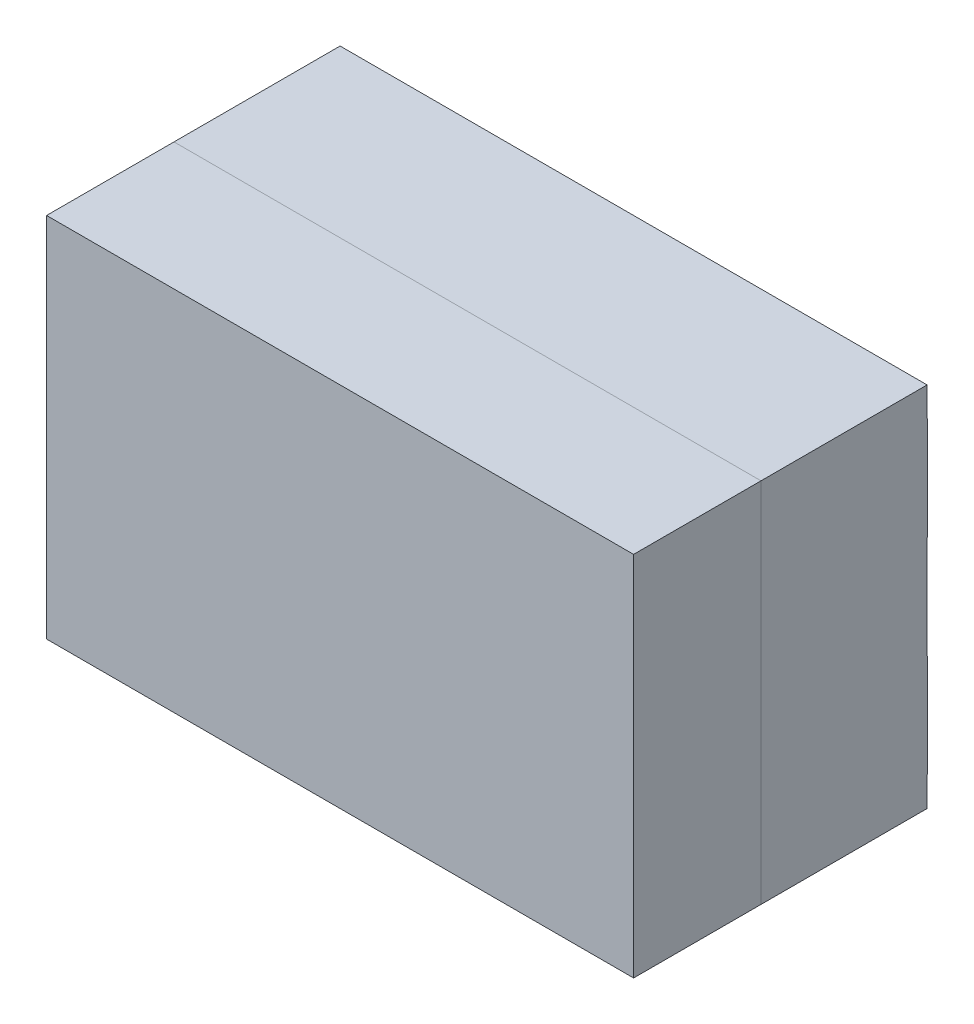
ISO-10303-21;
HEADER;
FILE_DESCRIPTION(('STEP AP214'),'2;1');
FILE_NAME('part.step','',(''),(''),'','','');
FILE_SCHEMA(('AUTOMOTIVE_DESIGN { 1 0 10303 214 1 1 1 1 }'));
ENDSEC;
DATA;
#1=APPLICATION_CONTEXT('core data for automotive mechanical design processes');
#2=APPLICATION_PROTOCOL_DEFINITION('international standard','automotive_design',2000,#1);
#3=PRODUCT_CONTEXT('',#1,'mechanical');
#4=PRODUCT('Part','Part','',(#3));
#5=PRODUCT_RELATED_PRODUCT_CATEGORY('part','',(#4));
#6=PRODUCT_DEFINITION_FORMATION('','',#4);
#7=PRODUCT_DEFINITION_CONTEXT('part definition',#1,'design');
#8=PRODUCT_DEFINITION('design','',#6,#7);
#9=PRODUCT_DEFINITION_SHAPE('','',#8);
#10=(LENGTH_UNIT() NAMED_UNIT(*) SI_UNIT(.MILLI.,.METRE.));
#11=(NAMED_UNIT(*) PLANE_ANGLE_UNIT() SI_UNIT($,.RADIAN.));
#12=(NAMED_UNIT(*) SI_UNIT($,.STERADIAN.) SOLID_ANGLE_UNIT());
#13=UNCERTAINTY_MEASURE_WITH_UNIT(LENGTH_MEASURE(1.E-05),#10,'distance_accuracy_value','');
#14=(GEOMETRIC_REPRESENTATION_CONTEXT(3) GLOBAL_UNCERTAINTY_ASSIGNED_CONTEXT((#13)) GLOBAL_UNIT_ASSIGNED_CONTEXT((#10,
#11,#12)) REPRESENTATION_CONTEXT('',''));
#15=CARTESIAN_POINT('',(0.,0.,0.));
#16=DIRECTION('',(0.,0.,1.));
#17=DIRECTION('',(1.,0.,0.));
#18=AXIS2_PLACEMENT_3D('',#15,#16,#17);
#19=CARTESIAN_POINT('',(0.,0.625,0.5));
#20=DIRECTION('',(0.,1.,0.));
#21=DIRECTION('',(1.,0.,0.));
#22=AXIS2_PLACEMENT_3D('',#19,#20,#21);
#23=PLANE('',#22);
#24=DIRECTION('',(0.,0.,-1.));
#25=VECTOR('',#24,1.);
#26=CARTESIAN_POINT('',(-1.,0.625,1.));
#27=LINE('',#26,#25);
#28=CARTESIAN_POINT('',(-1.,0.625,1.));
#29=VERTEX_POINT('',#28);
#30=CARTESIAN_POINT('',(-1.,0.625,0.565940628466662));
#31=VERTEX_POINT('',#30);
#32=EDGE_CURVE('E60',#29,#31,#27,.T.);
#33=ORIENTED_EDGE('',*,*,#32,.F.);
#34=DIRECTION('',(-1.,0.,0.));
#35=VECTOR('',#34,1.);
#36=CARTESIAN_POINT('',(-1.,0.625,1.));
#37=LINE('',#36,#35);
#38=CARTESIAN_POINT('',(1.,0.625,1.));
#39=VERTEX_POINT('',#38);
#40=EDGE_CURVE('E83',#39,#29,#37,.T.);
#41=ORIENTED_EDGE('',*,*,#40,.F.);
#42=DIRECTION('',(0.,0.,1.));
#43=VECTOR('',#42,1.);
#44=CARTESIAN_POINT('',(1.,0.625,1.));
#45=LINE('',#44,#43);
#46=CARTESIAN_POINT('',(1.,0.625,0.565940628466662));
#47=VERTEX_POINT('',#46);
#48=EDGE_CURVE('E88',#47,#39,#45,.T.);
#49=ORIENTED_EDGE('',*,*,#48,.F.);
#50=DIRECTION('',(1.,0.,0.));
#51=VECTOR('',#50,1.);
#52=CARTESIAN_POINT('',(-1.,0.625,0.565940628466662));
#53=LINE('',#52,#51);
#54=EDGE_CURVE('E103',#31,#47,#53,.T.);
#55=ORIENTED_EDGE('',*,*,#54,.F.);
#56=EDGE_LOOP('',(#33,#41,#49,#55));
#57=FACE_BOUND('',#56,.T.);
#58=ADVANCED_FACE('F52',(#57),#23,.T.);
#59=CARTESIAN_POINT('',(0.,-0.625,0.));
#60=DIRECTION('',(0.,-1.,0.));
#61=DIRECTION('',(0.,0.,-1.));
#62=AXIS2_PLACEMENT_3D('',#59,#60,#61);
#63=PLANE('',#62);
#64=DIRECTION('',(0.,0.,-1.));
#65=VECTOR('',#64,1.);
#66=CARTESIAN_POINT('',(-1.,-0.625,1.));
#67=LINE('',#66,#65);
#68=CARTESIAN_POINT('',(-1.,-0.625,1.));
#69=VERTEX_POINT('',#68);
#70=CARTESIAN_POINT('',(-1.,-0.625,0.565940628466662));
#71=VERTEX_POINT('',#70);
#72=EDGE_CURVE('E112',#69,#71,#67,.T.);
#73=ORIENTED_EDGE('',*,*,#72,.T.);
#74=DIRECTION('',(1.,0.,0.));
#75=VECTOR('',#74,1.);
#76=CARTESIAN_POINT('',(-1.,-0.625,0.565940628466662));
#77=LINE('',#76,#75);
#78=CARTESIAN_POINT('',(1.,-0.625,0.565940628466662));
#79=VERTEX_POINT('',#78);
#80=EDGE_CURVE('E101',#71,#79,#77,.T.);
#81=ORIENTED_EDGE('',*,*,#80,.T.);
#82=DIRECTION('',(0.,0.,1.));
#83=VECTOR('',#82,1.);
#84=CARTESIAN_POINT('',(1.,-0.625,1.));
#85=LINE('',#84,#83);
#86=CARTESIAN_POINT('',(1.,-0.625,1.));
#87=VERTEX_POINT('',#86);
#88=EDGE_CURVE('E104',#79,#87,#85,.T.);
#89=ORIENTED_EDGE('',*,*,#88,.T.);
#90=DIRECTION('',(-1.,0.,0.));
#91=VECTOR('',#90,1.);
#92=CARTESIAN_POINT('',(-1.,-0.625,1.));
#93=LINE('',#92,#91);
#94=EDGE_CURVE('E109',#87,#69,#93,.T.);
#95=ORIENTED_EDGE('',*,*,#94,.T.);
#96=EDGE_LOOP('',(#73,#81,#89,#95));
#97=FACE_BOUND('',#96,.T.);
#98=ADVANCED_FACE('F111',(#97),#63,.T.);
#99=CARTESIAN_POINT('',(-1.,2.67155992778514,0.565940628466662));
#100=DIRECTION('',(0.,0.,-1.));
#101=DIRECTION('',(-1.,0.,0.));
#102=AXIS2_PLACEMENT_3D('',#99,#100,#101);
#103=PLANE('',#102);
#104=DIRECTION('',(0.,-1.,0.));
#105=VECTOR('',#104,1.);
#106=CARTESIAN_POINT('',(-1.,2.67155992778514,0.565940628466662));
#107=LINE('',#106,#105);
#108=EDGE_CURVE('E12',#31,#71,#107,.T.);
#109=ORIENTED_EDGE('',*,*,#108,.F.);
#110=ORIENTED_EDGE('',*,*,#54,.T.);
#111=DIRECTION('',(0.,-1.,0.));
#112=VECTOR('',#111,1.);
#113=CARTESIAN_POINT('',(1.,2.67155992778514,0.565940628466662));
#114=LINE('',#113,#112);
#115=EDGE_CURVE('E98',#47,#79,#114,.T.);
#116=ORIENTED_EDGE('',*,*,#115,.T.);
#117=ORIENTED_EDGE('',*,*,#80,.F.);
#118=EDGE_LOOP('',(#109,#110,#116,#117));
#119=FACE_BOUND('',#118,.T.);
#120=ADVANCED_FACE('F99',(#119),#103,.T.);
#121=CARTESIAN_POINT('',(1.,2.67155992778514,1.));
#122=DIRECTION('',(1.,0.,0.));
#123=DIRECTION('',(0.,0.,-1.));
#124=AXIS2_PLACEMENT_3D('',#121,#122,#123);
#125=PLANE('',#124);
#126=ORIENTED_EDGE('',*,*,#115,.F.);
#127=ORIENTED_EDGE('',*,*,#48,.T.);
#128=DIRECTION('',(0.,-1.,0.));
#129=VECTOR('',#128,1.);
#130=CARTESIAN_POINT('',(1.,2.67155992778514,1.));
#131=LINE('',#130,#129);
#132=EDGE_CURVE('E93',#39,#87,#131,.T.);
#133=ORIENTED_EDGE('',*,*,#132,.T.);
#134=ORIENTED_EDGE('',*,*,#88,.F.);
#135=EDGE_LOOP('',(#126,#127,#133,#134));
#136=FACE_BOUND('',#135,.T.);
#137=ADVANCED_FACE('F105',(#136),#125,.T.);
#138=CARTESIAN_POINT('',(-1.,2.67155992778514,1.));
#139=DIRECTION('',(0.,0.,1.));
#140=DIRECTION('',(1.,0.,0.));
#141=AXIS2_PLACEMENT_3D('',#138,#139,#140);
#142=PLANE('',#141);
#143=ORIENTED_EDGE('',*,*,#132,.F.);
#144=ORIENTED_EDGE('',*,*,#40,.T.);
#145=DIRECTION('',(0.,-1.,0.));
#146=VECTOR('',#145,1.);
#147=CARTESIAN_POINT('',(-1.,2.67155992778514,1.));
#148=LINE('',#147,#146);
#149=EDGE_CURVE('E119',#29,#69,#148,.T.);
#150=ORIENTED_EDGE('',*,*,#149,.T.);
#151=ORIENTED_EDGE('',*,*,#94,.F.);
#152=EDGE_LOOP('',(#143,#144,#150,#151));
#153=FACE_BOUND('',#152,.T.);
#154=ADVANCED_FACE('F125',(#153),#142,.T.);
#155=CARTESIAN_POINT('',(-1.,2.67155992778514,1.));
#156=DIRECTION('',(-1.,0.,0.));
#157=DIRECTION('',(0.,0.,1.));
#158=AXIS2_PLACEMENT_3D('',#155,#156,#157);
#159=PLANE('',#158);
#160=ORIENTED_EDGE('',*,*,#149,.F.);
#161=ORIENTED_EDGE('',*,*,#32,.T.);
#162=ORIENTED_EDGE('',*,*,#108,.T.);
#163=ORIENTED_EDGE('',*,*,#72,.F.);
#164=EDGE_LOOP('',(#160,#161,#162,#163));
#165=FACE_BOUND('',#164,.T.);
#166=ADVANCED_FACE('F126',(#165),#159,.T.);
#167=CLOSED_SHELL('',(#58,#98,#120,#137,#154,#166));
#168=MANIFOLD_SOLID_BREP('B2',#167);
#169=CARTESIAN_POINT('',(0.,0.625,0.5));
#170=DIRECTION('',(0.,1.,0.));
#171=DIRECTION('',(1.,0.,0.));
#172=AXIS2_PLACEMENT_3D('',#169,#170,#171);
#173=PLANE('',#172);
#174=DIRECTION('',(1.,0.,0.));
#175=VECTOR('',#174,1.);
#176=CARTESIAN_POINT('',(-1.,0.625,0.565940628466662));
#177=LINE('',#176,#175);
#178=CARTESIAN_POINT('',(-1.,0.625,0.565940628466662));
#179=VERTEX_POINT('',#178);
#180=CARTESIAN_POINT('',(1.,0.625,0.565940628466662));
#181=VERTEX_POINT('',#180);
#182=EDGE_CURVE('E604',#179,#181,#177,.T.);
#183=ORIENTED_EDGE('',*,*,#182,.T.);
#184=DIRECTION('',(0.,0.,-1.));
#185=VECTOR('',#184,1.);
#186=CARTESIAN_POINT('',(1.,0.625,1.));
#187=LINE('',#186,#185);
#188=CARTESIAN_POINT('',(1.,0.625,0.));
#189=VERTEX_POINT('',#188);
#190=EDGE_CURVE('E208',#181,#189,#187,.T.);
#191=ORIENTED_EDGE('',*,*,#190,.T.);
#192=DIRECTION('',(-1.,0.,0.));
#193=VECTOR('',#192,1.);
#194=CARTESIAN_POINT('',(1.,0.625,0.));
#195=LINE('',#194,#193);
#196=CARTESIAN_POINT('',(-1.,0.625,0.));
#197=VERTEX_POINT('',#196);
#198=EDGE_CURVE('E439',#189,#197,#195,.T.);
#199=ORIENTED_EDGE('',*,*,#198,.T.);
#200=DIRECTION('',(0.,0.,1.));
#201=VECTOR('',#200,1.);
#202=CARTESIAN_POINT('',(-1.,0.625,0.));
#203=LINE('',#202,#201);
#204=EDGE_CURVE('E50',#197,#179,#203,.T.);
#205=ORIENTED_EDGE('',*,*,#204,.T.);
#206=EDGE_LOOP('',(#183,#191,#199,#205));
#207=FACE_BOUND('',#206,.T.);
#208=ADVANCED_FACE('F177',(#207),#173,.T.);
#209=CARTESIAN_POINT('',(-1.,0.,0.5));
#210=DIRECTION('',(1.,0.,0.));
#211=DIRECTION('',(0.,1.,0.));
#212=AXIS2_PLACEMENT_3D('',#209,#210,#211);
#213=PLANE('',#212);
#214=DIRECTION('',(0.,0.,-1.));
#215=VECTOR('',#214,1.);
#216=CARTESIAN_POINT('',(-1.,-0.625,1.));
#217=LINE('',#216,#215);
#218=CARTESIAN_POINT('',(-1.,-0.625,0.565940628466662));
#219=VERTEX_POINT('',#218);
#220=CARTESIAN_POINT('',(-1.,-0.625,0.));
#221=VERTEX_POINT('',#220);
#222=EDGE_CURVE('E187',#219,#221,#217,.T.);
#223=ORIENTED_EDGE('',*,*,#222,.F.);
#224=DIRECTION('',(0.,-1.,0.));
#225=VECTOR('',#224,1.);
#226=CARTESIAN_POINT('',(-1.,0.625,0.565940628466662));
#227=LINE('',#226,#225);
#228=EDGE_CURVE('E566',#179,#219,#227,.T.);
#229=ORIENTED_EDGE('',*,*,#228,.F.);
#230=ORIENTED_EDGE('',*,*,#204,.F.);
#231=DIRECTION('',(0.,-1.,0.));
#232=VECTOR('',#231,1.);
#233=CARTESIAN_POINT('',(-1.,0.625,0.));
#234=LINE('',#233,#232);
#235=CARTESIAN_POINT('',(-1.,0.525,0.));
#236=VERTEX_POINT('',#235);
#237=EDGE_CURVE('E415',#197,#236,#234,.T.);
#238=ORIENTED_EDGE('',*,*,#237,.T.);
#239=DIRECTION('',(0.,0.,-1.));
#240=VECTOR('',#239,1.);
#241=CARTESIAN_POINT('',(-1.,0.525,0.1));
#242=LINE('',#241,#240);
#243=CARTESIAN_POINT('',(-1.,0.525,-0.001));
#244=VERTEX_POINT('',#243);
#245=EDGE_CURVE('E181',#236,#244,#242,.T.);
#246=ORIENTED_EDGE('',*,*,#245,.T.);
#247=DIRECTION('',(0.,1.,0.));
#248=VECTOR('',#247,1.);
#249=CARTESIAN_POINT('',(-1.,0.175,-0.001));
#250=LINE('',#249,#248);
#251=CARTESIAN_POINT('',(-1.,0.175,-0.001));
#252=VERTEX_POINT('',#251);
#253=EDGE_CURVE('E322',#252,#244,#250,.T.);
#254=ORIENTED_EDGE('',*,*,#253,.F.);
#255=DIRECTION('',(0.,0.,-1.));
#256=VECTOR('',#255,1.);
#257=CARTESIAN_POINT('',(-1.,0.175,0.1));
#258=LINE('',#257,#256);
#259=CARTESIAN_POINT('',(-1.,0.175,0.));
#260=VERTEX_POINT('',#259);
#261=EDGE_CURVE('E465',#260,#252,#258,.T.);
#262=ORIENTED_EDGE('',*,*,#261,.F.);
#263=DIRECTION('',(0.,-1.,0.));
#264=VECTOR('',#263,1.);
#265=CARTESIAN_POINT('',(-1.,0.175,0.));
#266=LINE('',#265,#264);
#267=CARTESIAN_POINT('',(-1.,-0.175,0.));
#268=VERTEX_POINT('',#267);
#269=EDGE_CURVE('E412',#260,#268,#266,.T.);
#270=ORIENTED_EDGE('',*,*,#269,.T.);
#271=DIRECTION('',(0.,0.,-1.));
#272=VECTOR('',#271,1.);
#273=CARTESIAN_POINT('',(-1.,-0.175,0.1));
#274=LINE('',#273,#272);
#275=CARTESIAN_POINT('',(-1.,-0.175,-0.001));
#276=VERTEX_POINT('',#275);
#277=EDGE_CURVE('E440',#268,#276,#274,.T.);
#278=ORIENTED_EDGE('',*,*,#277,.T.);
#279=DIRECTION('',(0.,1.,0.));
#280=VECTOR('',#279,1.);
#281=CARTESIAN_POINT('',(-1.,-0.525,-0.001));
#282=LINE('',#281,#280);
#283=CARTESIAN_POINT('',(-1.,-0.525,-0.001));
#284=VERTEX_POINT('',#283);
#285=EDGE_CURVE('E433',#284,#276,#282,.T.);
#286=ORIENTED_EDGE('',*,*,#285,.F.);
#287=DIRECTION('',(0.,0.,-1.));
#288=VECTOR('',#287,1.);
#289=CARTESIAN_POINT('',(-1.,-0.525,0.1));
#290=LINE('',#289,#288);
#291=CARTESIAN_POINT('',(-1.,-0.525,0.));
#292=VERTEX_POINT('',#291);
#293=EDGE_CURVE('E460',#292,#284,#290,.T.);
#294=ORIENTED_EDGE('',*,*,#293,.F.);
#295=DIRECTION('',(0.,-1.,0.));
#296=VECTOR('',#295,1.);
#297=CARTESIAN_POINT('',(-1.,-0.525,0.));
#298=LINE('',#297,#296);
#299=EDGE_CURVE('E416',#292,#221,#298,.T.);
#300=ORIENTED_EDGE('',*,*,#299,.T.);
#301=EDGE_LOOP('',(#223,#229,#230,#238,#246,#254,#262,#270,#278,#286,#294,#300));
#302=FACE_BOUND('',#301,.T.);
#303=ADVANCED_FACE('F609',(#302),#213,.F.);
#304=CARTESIAN_POINT('',(0.,-0.625,0.5));
#305=DIRECTION('',(0.,1.,0.));
#306=DIRECTION('',(1.,0.,0.));
#307=AXIS2_PLACEMENT_3D('',#304,#305,#306);
#308=PLANE('',#307);
#309=DIRECTION('',(0.,0.,1.));
#310=VECTOR('',#309,1.);
#311=CARTESIAN_POINT('',(1.,-0.625,0.));
#312=LINE('',#311,#310);
#313=CARTESIAN_POINT('',(1.,-0.625,0.));
#314=VERTEX_POINT('',#313);
#315=CARTESIAN_POINT('',(1.,-0.625,0.565940628466662));
#316=VERTEX_POINT('',#315);
#317=EDGE_CURVE('E518',#314,#316,#312,.T.);
#318=ORIENTED_EDGE('',*,*,#317,.T.);
#319=DIRECTION('',(1.,0.,0.));
#320=VECTOR('',#319,1.);
#321=CARTESIAN_POINT('',(-1.,-0.625,0.565940628466662));
#322=LINE('',#321,#320);
#323=EDGE_CURVE('E195',#219,#316,#322,.T.);
#324=ORIENTED_EDGE('',*,*,#323,.F.);
#325=ORIENTED_EDGE('',*,*,#222,.T.);
#326=DIRECTION('',(1.,0.,0.));
#327=VECTOR('',#326,1.);
#328=CARTESIAN_POINT('',(-1.,-0.625,0.));
#329=LINE('',#328,#327);
#330=EDGE_CURVE('E432',#221,#314,#329,.T.);
#331=ORIENTED_EDGE('',*,*,#330,.T.);
#332=EDGE_LOOP('',(#318,#324,#325,#331));
#333=FACE_BOUND('',#332,.T.);
#334=ADVANCED_FACE('F615',(#333),#308,.F.);
#335=CARTESIAN_POINT('',(1.,0.,0.5));
#336=DIRECTION('',(1.,0.,0.));
#337=DIRECTION('',(0.,1.,0.));
#338=AXIS2_PLACEMENT_3D('',#335,#336,#337);
#339=PLANE('',#338);
#340=DIRECTION('',(0.,-1.,0.));
#341=VECTOR('',#340,1.);
#342=CARTESIAN_POINT('',(1.,0.625,0.565940628466662));
#343=LINE('',#342,#341);
#344=EDGE_CURVE('E451',#181,#316,#343,.T.);
#345=ORIENTED_EDGE('',*,*,#344,.T.);
#346=ORIENTED_EDGE('',*,*,#317,.F.);
#347=DIRECTION('',(0.,1.,0.));
#348=VECTOR('',#347,1.);
#349=CARTESIAN_POINT('',(1.,-0.625,0.));
#350=LINE('',#349,#348);
#351=CARTESIAN_POINT('',(1.,-0.525,0.));
#352=VERTEX_POINT('',#351);
#353=EDGE_CURVE('E428',#314,#352,#350,.T.);
#354=ORIENTED_EDGE('',*,*,#353,.T.);
#355=DIRECTION('',(0.,0.,-1.));
#356=VECTOR('',#355,1.);
#357=CARTESIAN_POINT('',(1.,-0.525,0.1));
#358=LINE('',#357,#356);
#359=CARTESIAN_POINT('',(1.,-0.525,-0.001));
#360=VERTEX_POINT('',#359);
#361=EDGE_CURVE('E503',#352,#360,#358,.T.);
#362=ORIENTED_EDGE('',*,*,#361,.T.);
#363=DIRECTION('',(0.,-1.,0.));
#364=VECTOR('',#363,1.);
#365=CARTESIAN_POINT('',(1.,-0.175,-0.001));
#366=LINE('',#365,#364);
#367=CARTESIAN_POINT('',(1.,-0.175,-0.001));
#368=VERTEX_POINT('',#367);
#369=EDGE_CURVE('E233',#368,#360,#366,.T.);
#370=ORIENTED_EDGE('',*,*,#369,.F.);
#371=DIRECTION('',(0.,0.,-1.));
#372=VECTOR('',#371,1.);
#373=CARTESIAN_POINT('',(1.,-0.175,0.1));
#374=LINE('',#373,#372);
#375=CARTESIAN_POINT('',(1.,-0.175,0.));
#376=VERTEX_POINT('',#375);
#377=EDGE_CURVE('E490',#376,#368,#374,.T.);
#378=ORIENTED_EDGE('',*,*,#377,.F.);
#379=DIRECTION('',(0.,1.,0.));
#380=VECTOR('',#379,1.);
#381=CARTESIAN_POINT('',(1.,-0.175,0.));
#382=LINE('',#381,#380);
#383=CARTESIAN_POINT('',(1.,0.175,0.));
#384=VERTEX_POINT('',#383);
#385=EDGE_CURVE('E248',#376,#384,#382,.T.);
#386=ORIENTED_EDGE('',*,*,#385,.T.);
#387=DIRECTION('',(0.,0.,-1.));
#388=VECTOR('',#387,1.);
#389=CARTESIAN_POINT('',(1.,0.175,0.1));
#390=LINE('',#389,#388);
#391=CARTESIAN_POINT('',(1.,0.175,-0.001));
#392=VERTEX_POINT('',#391);
#393=EDGE_CURVE('E392',#384,#392,#390,.T.);
#394=ORIENTED_EDGE('',*,*,#393,.T.);
#395=DIRECTION('',(0.,-1.,0.));
#396=VECTOR('',#395,1.);
#397=CARTESIAN_POINT('',(1.,0.525,-0.001));
#398=LINE('',#397,#396);
#399=CARTESIAN_POINT('',(1.,0.525,-0.001));
#400=VERTEX_POINT('',#399);
#401=EDGE_CURVE('E378',#400,#392,#398,.T.);
#402=ORIENTED_EDGE('',*,*,#401,.F.);
#403=DIRECTION('',(0.,0.,-1.));
#404=VECTOR('',#403,1.);
#405=CARTESIAN_POINT('',(1.,0.525,0.1));
#406=LINE('',#405,#404);
#407=CARTESIAN_POINT('',(1.,0.525,0.));
#408=VERTEX_POINT('',#407);
#409=EDGE_CURVE('E466',#408,#400,#406,.T.);
#410=ORIENTED_EDGE('',*,*,#409,.F.);
#411=DIRECTION('',(0.,1.,0.));
#412=VECTOR('',#411,1.);
#413=CARTESIAN_POINT('',(1.,0.525,0.));
#414=LINE('',#413,#412);
#415=EDGE_CURVE('E525',#408,#189,#414,.T.);
#416=ORIENTED_EDGE('',*,*,#415,.T.);
#417=ORIENTED_EDGE('',*,*,#190,.F.);
#418=EDGE_LOOP('',(#345,#346,#354,#362,#370,#378,#386,#394,#402,#410,#416,#417));
#419=FACE_BOUND('',#418,.T.);
#420=ADVANCED_FACE('F179',(#419),#339,.T.);
#421=CARTESIAN_POINT('',(0.,0.,0.));
#422=DIRECTION('',(0.,0.,1.));
#423=DIRECTION('',(1.,0.,0.));
#424=AXIS2_PLACEMENT_3D('',#421,#422,#423);
#425=PLANE('',#424);
#426=DIRECTION('',(-1.,0.,0.));
#427=VECTOR('',#426,1.);
#428=CARTESIAN_POINT('',(1.,0.175,0.));
#429=LINE('',#428,#427);
#430=CARTESIAN_POINT('',(0.55,0.175,0.));
#431=VERTEX_POINT('',#430);
#432=EDGE_CURVE('E406',#384,#431,#429,.T.);
#433=ORIENTED_EDGE('',*,*,#432,.F.);
#434=ORIENTED_EDGE('',*,*,#385,.F.);
#435=DIRECTION('',(1.,0.,0.));
#436=VECTOR('',#435,1.);
#437=CARTESIAN_POINT('',(0.45,-0.175,0.));
#438=LINE('',#437,#436);
#439=CARTESIAN_POINT('',(0.45,-0.175,0.));
#440=VERTEX_POINT('',#439);
#441=EDGE_CURVE('E493',#440,#376,#438,.T.);
#442=ORIENTED_EDGE('',*,*,#441,.F.);
#443=DIRECTION('',(0.,1.,0.));
#444=VECTOR('',#443,1.);
#445=CARTESIAN_POINT('',(0.45,-0.525,0.));
#446=LINE('',#445,#444);
#447=CARTESIAN_POINT('',(0.45,-0.525,0.));
#448=VERTEX_POINT('',#447);
#449=EDGE_CURVE('E422',#448,#440,#446,.T.);
#450=ORIENTED_EDGE('',*,*,#449,.F.);
#451=DIRECTION('',(-1.,0.,0.));
#452=VECTOR('',#451,1.);
#453=CARTESIAN_POINT('',(1.,-0.525,0.));
#454=LINE('',#453,#452);
#455=EDGE_CURVE('E474',#352,#448,#454,.T.);
#456=ORIENTED_EDGE('',*,*,#455,.F.);
#457=ORIENTED_EDGE('',*,*,#353,.F.);
#458=ORIENTED_EDGE('',*,*,#330,.F.);
#459=ORIENTED_EDGE('',*,*,#299,.F.);
#460=DIRECTION('',(-1.,0.,0.));
#461=VECTOR('',#460,1.);
#462=CARTESIAN_POINT('',(-0.55,-0.525,0.));
#463=LINE('',#462,#461);
#464=CARTESIAN_POINT('',(-0.55,-0.525,0.));
#465=VERTEX_POINT('',#464);
#466=EDGE_CURVE('E456',#465,#292,#463,.T.);
#467=ORIENTED_EDGE('',*,*,#466,.F.);
#468=DIRECTION('',(0.,-1.,0.));
#469=VECTOR('',#468,1.);
#470=CARTESIAN_POINT('',(-0.55,-0.175,0.));
#471=LINE('',#470,#469);
#472=CARTESIAN_POINT('',(-0.55,-0.175,0.));
#473=VERTEX_POINT('',#472);
#474=EDGE_CURVE('E444',#473,#465,#471,.T.);
#475=ORIENTED_EDGE('',*,*,#474,.F.);
#476=DIRECTION('',(1.,0.,0.));
#477=VECTOR('',#476,1.);
#478=CARTESIAN_POINT('',(-1.,-0.175,0.));
#479=LINE('',#478,#477);
#480=EDGE_CURVE('E446',#268,#473,#479,.T.);
#481=ORIENTED_EDGE('',*,*,#480,.F.);
#482=ORIENTED_EDGE('',*,*,#269,.F.);
#483=DIRECTION('',(-1.,0.,0.));
#484=VECTOR('',#483,1.);
#485=CARTESIAN_POINT('',(-0.55,0.175,0.));
#486=LINE('',#485,#484);
#487=CARTESIAN_POINT('',(-0.55,0.175,0.));
#488=VERTEX_POINT('',#487);
#489=EDGE_CURVE('E542',#488,#260,#486,.T.);
#490=ORIENTED_EDGE('',*,*,#489,.F.);
#491=DIRECTION('',(0.,-1.,0.));
#492=VECTOR('',#491,1.);
#493=CARTESIAN_POINT('',(-0.55,0.525,0.));
#494=LINE('',#493,#492);
#495=CARTESIAN_POINT('',(-0.55,0.525,0.));
#496=VERTEX_POINT('',#495);
#497=EDGE_CURVE('E554',#496,#488,#494,.T.);
#498=ORIENTED_EDGE('',*,*,#497,.F.);
#499=DIRECTION('',(1.,0.,0.));
#500=VECTOR('',#499,1.);
#501=CARTESIAN_POINT('',(-1.,0.525,0.));
#502=LINE('',#501,#500);
#503=EDGE_CURVE('E389',#236,#496,#502,.T.);
#504=ORIENTED_EDGE('',*,*,#503,.F.);
#505=ORIENTED_EDGE('',*,*,#237,.F.);
#506=ORIENTED_EDGE('',*,*,#198,.F.);
#507=ORIENTED_EDGE('',*,*,#415,.F.);
#508=DIRECTION('',(1.,0.,0.));
#509=VECTOR('',#508,1.);
#510=CARTESIAN_POINT('',(0.55,0.525,0.));
#511=LINE('',#510,#509);
#512=CARTESIAN_POINT('',(0.55,0.525,0.));
#513=VERTEX_POINT('',#512);
#514=EDGE_CURVE('E469',#513,#408,#511,.T.);
#515=ORIENTED_EDGE('',*,*,#514,.F.);
#516=DIRECTION('',(0.,1.,0.));
#517=VECTOR('',#516,1.);
#518=CARTESIAN_POINT('',(0.55,0.175,0.));
#519=LINE('',#518,#517);
#520=EDGE_CURVE('E396',#431,#513,#519,.T.);
#521=ORIENTED_EDGE('',*,*,#520,.F.);
#522=EDGE_LOOP('',(#433,#434,#442,#450,#456,#457,#458,#459,#467,#475,#481,#482,#490,#498,#504,
#505,#506,#507,#515,#521));
#523=FACE_BOUND('',#522,.T.);
#524=ADVANCED_FACE('F600',(#523),#425,.F.);
#525=CARTESIAN_POINT('',(0.725,-0.35,-0.001));
#526=DIRECTION('',(0.,0.,-1.));
#527=DIRECTION('',(0.,-1.,0.));
#528=AXIS2_PLACEMENT_3D('',#525,#526,#527);
#529=PLANE('',#528);
#530=ORIENTED_EDGE('',*,*,#369,.T.);
#531=DIRECTION('',(-1.,0.,0.));
#532=VECTOR('',#531,1.);
#533=CARTESIAN_POINT('',(1.,-0.525,-0.001));
#534=LINE('',#533,#532);
#535=CARTESIAN_POINT('',(0.45,-0.525,-0.001));
#536=VERTEX_POINT('',#535);
#537=EDGE_CURVE('E409',#360,#536,#534,.T.);
#538=ORIENTED_EDGE('',*,*,#537,.T.);
#539=DIRECTION('',(0.,1.,0.));
#540=VECTOR('',#539,1.);
#541=CARTESIAN_POINT('',(0.45,-0.525,-0.001));
#542=LINE('',#541,#540);
#543=CARTESIAN_POINT('',(0.45,-0.175,-0.001));
#544=VERTEX_POINT('',#543);
#545=EDGE_CURVE('E421',#536,#544,#542,.T.);
#546=ORIENTED_EDGE('',*,*,#545,.T.);
#547=DIRECTION('',(1.,0.,0.));
#548=VECTOR('',#547,1.);
#549=CARTESIAN_POINT('',(0.45,-0.175,-0.001));
#550=LINE('',#549,#548);
#551=EDGE_CURVE('E425',#544,#368,#550,.T.);
#552=ORIENTED_EDGE('',*,*,#551,.T.);
#553=EDGE_LOOP('',(#530,#538,#546,#552));
#554=FACE_BOUND('',#553,.T.);
#555=ADVANCED_FACE('F654',(#554),#529,.T.);
#556=CARTESIAN_POINT('',(0.45,-0.175,0.1));
#557=DIRECTION('',(0.,1.,0.));
#558=DIRECTION('',(1.,0.,0.));
#559=AXIS2_PLACEMENT_3D('',#556,#557,#558);
#560=PLANE('',#559);
#561=ORIENTED_EDGE('',*,*,#441,.T.);
#562=ORIENTED_EDGE('',*,*,#377,.T.);
#563=ORIENTED_EDGE('',*,*,#551,.F.);
#564=DIRECTION('',(0.,0.,-1.));
#565=VECTOR('',#564,1.);
#566=CARTESIAN_POINT('',(0.45,-0.175,0.1));
#567=LINE('',#566,#565);
#568=EDGE_CURVE('E417',#440,#544,#567,.T.);
#569=ORIENTED_EDGE('',*,*,#568,.F.);
#570=EDGE_LOOP('',(#561,#562,#563,#569));
#571=FACE_BOUND('',#570,.T.);
#572=ADVANCED_FACE('F649',(#571),#560,.T.);
#573=CARTESIAN_POINT('',(0.45,-0.525,0.1));
#574=DIRECTION('',(-1.,0.,0.));
#575=DIRECTION('',(0.,0.,1.));
#576=AXIS2_PLACEMENT_3D('',#573,#574,#575);
#577=PLANE('',#576);
#578=ORIENTED_EDGE('',*,*,#449,.T.);
#579=ORIENTED_EDGE('',*,*,#568,.T.);
#580=ORIENTED_EDGE('',*,*,#545,.F.);
#581=DIRECTION('',(0.,0.,-1.));
#582=VECTOR('',#581,1.);
#583=CARTESIAN_POINT('',(0.45,-0.525,0.1));
#584=LINE('',#583,#582);
#585=EDGE_CURVE('E478',#448,#536,#584,.T.);
#586=ORIENTED_EDGE('',*,*,#585,.F.);
#587=EDGE_LOOP('',(#578,#579,#580,#586));
#588=FACE_BOUND('',#587,.T.);
#589=ADVANCED_FACE('F653',(#588),#577,.T.);
#590=CARTESIAN_POINT('',(1.,-0.525,0.1));
#591=DIRECTION('',(0.,-1.,0.));
#592=DIRECTION('',(0.,0.,-1.));
#593=AXIS2_PLACEMENT_3D('',#590,#591,#592);
#594=PLANE('',#593);
#595=ORIENTED_EDGE('',*,*,#455,.T.);
#596=ORIENTED_EDGE('',*,*,#585,.T.);
#597=ORIENTED_EDGE('',*,*,#537,.F.);
#598=ORIENTED_EDGE('',*,*,#361,.F.);
#599=EDGE_LOOP('',(#595,#596,#597,#598));
#600=FACE_BOUND('',#599,.T.);
#601=ADVANCED_FACE('F740',(#600),#594,.T.);
#602=CARTESIAN_POINT('',(-0.775,0.35,-0.001));
#603=DIRECTION('',(0.,0.,-1.));
#604=DIRECTION('',(0.,-1.,0.));
#605=AXIS2_PLACEMENT_3D('',#602,#603,#604);
#606=PLANE('',#605);
#607=ORIENTED_EDGE('',*,*,#253,.T.);
#608=DIRECTION('',(1.,0.,0.));
#609=VECTOR('',#608,1.);
#610=CARTESIAN_POINT('',(-1.,0.525,-0.001));
#611=LINE('',#610,#609);
#612=CARTESIAN_POINT('',(-0.55,0.525,-0.001));
#613=VERTEX_POINT('',#612);
#614=EDGE_CURVE('E520',#244,#613,#611,.T.);
#615=ORIENTED_EDGE('',*,*,#614,.T.);
#616=DIRECTION('',(0.,-1.,0.));
#617=VECTOR('',#616,1.);
#618=CARTESIAN_POINT('',(-0.55,0.525,-0.001));
#619=LINE('',#618,#617);
#620=CARTESIAN_POINT('',(-0.55,0.175,-0.001));
#621=VERTEX_POINT('',#620);
#622=EDGE_CURVE('E334',#613,#621,#619,.T.);
#623=ORIENTED_EDGE('',*,*,#622,.T.);
#624=DIRECTION('',(-1.,0.,0.));
#625=VECTOR('',#624,1.);
#626=CARTESIAN_POINT('',(-0.55,0.175,-0.001));
#627=LINE('',#626,#625);
#628=EDGE_CURVE('E462',#621,#252,#627,.T.);
#629=ORIENTED_EDGE('',*,*,#628,.T.);
#630=EDGE_LOOP('',(#607,#615,#623,#629));
#631=FACE_BOUND('',#630,.T.);
#632=ADVANCED_FACE('F671',(#631),#606,.T.);
#633=CARTESIAN_POINT('',(-0.55,0.175,0.1));
#634=DIRECTION('',(0.,-1.,0.));
#635=DIRECTION('',(0.,0.,-1.));
#636=AXIS2_PLACEMENT_3D('',#633,#634,#635);
#637=PLANE('',#636);
#638=ORIENTED_EDGE('',*,*,#489,.T.);
#639=ORIENTED_EDGE('',*,*,#261,.T.);
#640=ORIENTED_EDGE('',*,*,#628,.F.);
#641=DIRECTION('',(0.,0.,-1.));
#642=VECTOR('',#641,1.);
#643=CARTESIAN_POINT('',(-0.55,0.175,0.1));
#644=LINE('',#643,#642);
#645=EDGE_CURVE('E543',#488,#621,#644,.T.);
#646=ORIENTED_EDGE('',*,*,#645,.F.);
#647=EDGE_LOOP('',(#638,#639,#640,#646));
#648=FACE_BOUND('',#647,.T.);
#649=ADVANCED_FACE('F667',(#648),#637,.T.);
#650=CARTESIAN_POINT('',(-0.55,0.525,0.1));
#651=DIRECTION('',(1.,0.,0.));
#652=DIRECTION('',(0.,1.,0.));
#653=AXIS2_PLACEMENT_3D('',#650,#651,#652);
#654=PLANE('',#653);
#655=ORIENTED_EDGE('',*,*,#497,.T.);
#656=ORIENTED_EDGE('',*,*,#645,.T.);
#657=ORIENTED_EDGE('',*,*,#622,.F.);
#658=DIRECTION('',(0.,0.,-1.));
#659=VECTOR('',#658,1.);
#660=CARTESIAN_POINT('',(-0.55,0.525,0.1));
#661=LINE('',#660,#659);
#662=EDGE_CURVE('E482',#496,#613,#661,.T.);
#663=ORIENTED_EDGE('',*,*,#662,.F.);
#664=EDGE_LOOP('',(#655,#656,#657,#663));
#665=FACE_BOUND('',#664,.T.);
#666=ADVANCED_FACE('F637',(#665),#654,.T.);
#667=CARTESIAN_POINT('',(-1.,0.525,0.1));
#668=DIRECTION('',(0.,1.,0.));
#669=DIRECTION('',(1.,0.,0.));
#670=AXIS2_PLACEMENT_3D('',#667,#668,#669);
#671=PLANE('',#670);
#672=ORIENTED_EDGE('',*,*,#503,.T.);
#673=ORIENTED_EDGE('',*,*,#662,.T.);
#674=ORIENTED_EDGE('',*,*,#614,.F.);
#675=ORIENTED_EDGE('',*,*,#245,.F.);
#676=EDGE_LOOP('',(#672,#673,#674,#675));
#677=FACE_BOUND('',#676,.T.);
#678=ADVANCED_FACE('F633',(#677),#671,.T.);
#679=CARTESIAN_POINT('',(0.775,0.35,-0.001));
#680=DIRECTION('',(0.,0.,-1.));
#681=DIRECTION('',(0.,-1.,0.));
#682=AXIS2_PLACEMENT_3D('',#679,#680,#681);
#683=PLANE('',#682);
#684=ORIENTED_EDGE('',*,*,#401,.T.);
#685=DIRECTION('',(-1.,0.,0.));
#686=VECTOR('',#685,1.);
#687=CARTESIAN_POINT('',(1.,0.175,-0.001));
#688=LINE('',#687,#686);
#689=CARTESIAN_POINT('',(0.55,0.175,-0.001));
#690=VERTEX_POINT('',#689);
#691=EDGE_CURVE('E383',#392,#690,#688,.T.);
#692=ORIENTED_EDGE('',*,*,#691,.T.);
#693=DIRECTION('',(0.,1.,0.));
#694=VECTOR('',#693,1.);
#695=CARTESIAN_POINT('',(0.55,0.175,-0.001));
#696=LINE('',#695,#694);
#697=CARTESIAN_POINT('',(0.55,0.525,-0.001));
#698=VERTEX_POINT('',#697);
#699=EDGE_CURVE('E473',#690,#698,#696,.T.);
#700=ORIENTED_EDGE('',*,*,#699,.T.);
#701=DIRECTION('',(1.,0.,0.));
#702=VECTOR('',#701,1.);
#703=CARTESIAN_POINT('',(0.55,0.525,-0.001));
#704=LINE('',#703,#702);
#705=EDGE_CURVE('E385',#698,#400,#704,.T.);
#706=ORIENTED_EDGE('',*,*,#705,.T.);
#707=EDGE_LOOP('',(#684,#692,#700,#706));
#708=FACE_BOUND('',#707,.T.);
#709=ADVANCED_FACE('F380',(#708),#683,.T.);
#710=CARTESIAN_POINT('',(0.55,0.525,0.1));
#711=DIRECTION('',(0.,1.,0.));
#712=DIRECTION('',(1.,0.,0.));
#713=AXIS2_PLACEMENT_3D('',#710,#711,#712);
#714=PLANE('',#713);
#715=ORIENTED_EDGE('',*,*,#514,.T.);
#716=ORIENTED_EDGE('',*,*,#409,.T.);
#717=ORIENTED_EDGE('',*,*,#705,.F.);
#718=DIRECTION('',(0.,0.,-1.));
#719=VECTOR('',#718,1.);
#720=CARTESIAN_POINT('',(0.55,0.525,0.1));
#721=LINE('',#720,#719);
#722=EDGE_CURVE('E489',#513,#698,#721,.T.);
#723=ORIENTED_EDGE('',*,*,#722,.F.);
#724=EDGE_LOOP('',(#715,#716,#717,#723));
#725=FACE_BOUND('',#724,.T.);
#726=ADVANCED_FACE('F681',(#725),#714,.T.);
#727=CARTESIAN_POINT('',(0.55,0.175,0.1));
#728=DIRECTION('',(-1.,0.,0.));
#729=DIRECTION('',(0.,0.,1.));
#730=AXIS2_PLACEMENT_3D('',#727,#728,#729);
#731=PLANE('',#730);
#732=ORIENTED_EDGE('',*,*,#520,.T.);
#733=ORIENTED_EDGE('',*,*,#722,.T.);
#734=ORIENTED_EDGE('',*,*,#699,.F.);
#735=DIRECTION('',(0.,0.,-1.));
#736=VECTOR('',#735,1.);
#737=CARTESIAN_POINT('',(0.55,0.175,0.1));
#738=LINE('',#737,#736);
#739=EDGE_CURVE('E400',#431,#690,#738,.T.);
#740=ORIENTED_EDGE('',*,*,#739,.F.);
#741=EDGE_LOOP('',(#732,#733,#734,#740));
#742=FACE_BOUND('',#741,.T.);
#743=ADVANCED_FACE('F677',(#742),#731,.T.);
#744=CARTESIAN_POINT('',(1.,0.175,0.1));
#745=DIRECTION('',(0.,-1.,0.));
#746=DIRECTION('',(0.,0.,-1.));
#747=AXIS2_PLACEMENT_3D('',#744,#745,#746);
#748=PLANE('',#747);
#749=ORIENTED_EDGE('',*,*,#432,.T.);
#750=ORIENTED_EDGE('',*,*,#739,.T.);
#751=ORIENTED_EDGE('',*,*,#691,.F.);
#752=ORIENTED_EDGE('',*,*,#393,.F.);
#753=EDGE_LOOP('',(#749,#750,#751,#752));
#754=FACE_BOUND('',#753,.T.);
#755=ADVANCED_FACE('F398',(#754),#748,.T.);
#756=CARTESIAN_POINT('',(-0.775,-0.35,-0.001));
#757=DIRECTION('',(0.,0.,-1.));
#758=DIRECTION('',(0.,-1.,0.));
#759=AXIS2_PLACEMENT_3D('',#756,#757,#758);
#760=PLANE('',#759);
#761=ORIENTED_EDGE('',*,*,#285,.T.);
#762=DIRECTION('',(1.,0.,0.));
#763=VECTOR('',#762,1.);
#764=CARTESIAN_POINT('',(-1.,-0.175,-0.001));
#765=LINE('',#764,#763);
#766=CARTESIAN_POINT('',(-0.55,-0.175,-0.001));
#767=VERTEX_POINT('',#766);
#768=EDGE_CURVE('E445',#276,#767,#765,.T.);
#769=ORIENTED_EDGE('',*,*,#768,.T.);
#770=DIRECTION('',(0.,-1.,0.));
#771=VECTOR('',#770,1.);
#772=CARTESIAN_POINT('',(-0.55,-0.175,-0.001));
#773=LINE('',#772,#771);
#774=CARTESIAN_POINT('',(-0.55,-0.525,-0.001));
#775=VERTEX_POINT('',#774);
#776=EDGE_CURVE('E452',#767,#775,#773,.T.);
#777=ORIENTED_EDGE('',*,*,#776,.T.);
#778=DIRECTION('',(-1.,0.,0.));
#779=VECTOR('',#778,1.);
#780=CARTESIAN_POINT('',(-0.55,-0.525,-0.001));
#781=LINE('',#780,#779);
#782=EDGE_CURVE('E436',#775,#284,#781,.T.);
#783=ORIENTED_EDGE('',*,*,#782,.T.);
#784=EDGE_LOOP('',(#761,#769,#777,#783));
#785=FACE_BOUND('',#784,.T.);
#786=ADVANCED_FACE('F705',(#785),#760,.T.);
#787=CARTESIAN_POINT('',(-0.55,-0.525,0.1));
#788=DIRECTION('',(0.,-1.,0.));
#789=DIRECTION('',(0.,0.,-1.));
#790=AXIS2_PLACEMENT_3D('',#787,#788,#789);
#791=PLANE('',#790);
#792=ORIENTED_EDGE('',*,*,#466,.T.);
#793=ORIENTED_EDGE('',*,*,#293,.T.);
#794=ORIENTED_EDGE('',*,*,#782,.F.);
#795=DIRECTION('',(0.,0.,-1.));
#796=VECTOR('',#795,1.);
#797=CARTESIAN_POINT('',(-0.55,-0.525,0.1));
#798=LINE('',#797,#796);
#799=EDGE_CURVE('E457',#465,#775,#798,.T.);
#800=ORIENTED_EDGE('',*,*,#799,.F.);
#801=EDGE_LOOP('',(#792,#793,#794,#800));
#802=FACE_BOUND('',#801,.T.);
#803=ADVANCED_FACE('F717',(#802),#791,.T.);
#804=CARTESIAN_POINT('',(-0.55,-0.175,0.1));
#805=DIRECTION('',(1.,0.,0.));
#806=DIRECTION('',(0.,1.,0.));
#807=AXIS2_PLACEMENT_3D('',#804,#805,#806);
#808=PLANE('',#807);
#809=ORIENTED_EDGE('',*,*,#474,.T.);
#810=ORIENTED_EDGE('',*,*,#799,.T.);
#811=ORIENTED_EDGE('',*,*,#776,.F.);
#812=DIRECTION('',(0.,0.,-1.));
#813=VECTOR('',#812,1.);
#814=CARTESIAN_POINT('',(-0.55,-0.175,0.1));
#815=LINE('',#814,#813);
#816=EDGE_CURVE('E450',#473,#767,#815,.T.);
#817=ORIENTED_EDGE('',*,*,#816,.F.);
#818=EDGE_LOOP('',(#809,#810,#811,#817));
#819=FACE_BOUND('',#818,.T.);
#820=ADVANCED_FACE('F721',(#819),#808,.T.);
#821=CARTESIAN_POINT('',(-1.,-0.175,0.1));
#822=DIRECTION('',(0.,1.,0.));
#823=DIRECTION('',(1.,0.,0.));
#824=AXIS2_PLACEMENT_3D('',#821,#822,#823);
#825=PLANE('',#824);
#826=ORIENTED_EDGE('',*,*,#480,.T.);
#827=ORIENTED_EDGE('',*,*,#816,.T.);
#828=ORIENTED_EDGE('',*,*,#768,.F.);
#829=ORIENTED_EDGE('',*,*,#277,.F.);
#830=EDGE_LOOP('',(#826,#827,#828,#829));
#831=FACE_BOUND('',#830,.T.);
#832=ADVANCED_FACE('F727',(#831),#825,.T.);
#833=CARTESIAN_POINT('',(-1.,0.625,0.565940628466662));
#834=DIRECTION('',(0.,0.,-1.));
#835=DIRECTION('',(-1.,0.,0.));
#836=AXIS2_PLACEMENT_3D('',#833,#834,#835);
#837=PLANE('',#836);
#838=ORIENTED_EDGE('',*,*,#323,.T.);
#839=ORIENTED_EDGE('',*,*,#344,.F.);
#840=ORIENTED_EDGE('',*,*,#182,.F.);
#841=ORIENTED_EDGE('',*,*,#228,.T.);
#842=EDGE_LOOP('',(#838,#839,#840,#841));
#843=FACE_BOUND('',#842,.T.);
#844=ADVANCED_FACE('F731',(#843),#837,.F.);
#845=CLOSED_SHELL('',(#208,#303,#334,#420,#524,#555,#572,#589,#601,#632,#649,#666,#678,#709,
#726,#743,#755,#786,#803,#820,#832,#844));
#846=MANIFOLD_SOLID_BREP('B6',#845);
#847=ADVANCED_BREP_SHAPE_REPRESENTATION('',(#18,#168,#846),#14);
#848=SHAPE_DEFINITION_REPRESENTATION(#9,#847);
ENDSEC;
END-ISO-10303-21;
